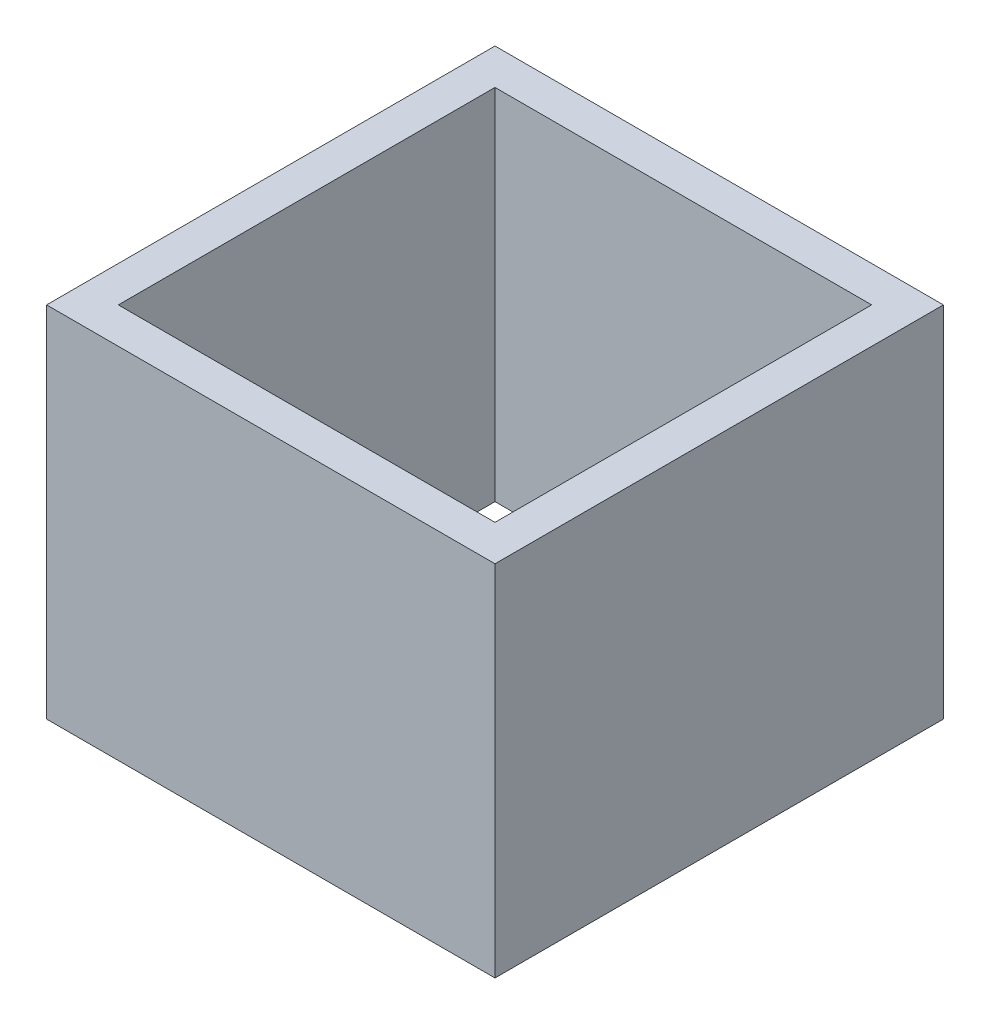
ISO-10303-21;
HEADER;
FILE_DESCRIPTION(('STEP AP214'),'2;1');
FILE_NAME('part.step','',(''),(''),'','','');
FILE_SCHEMA(('AUTOMOTIVE_DESIGN { 1 0 10303 214 1 1 1 1 }'));
ENDSEC;
DATA;
#1=APPLICATION_CONTEXT('core data for automotive mechanical design processes');
#2=APPLICATION_PROTOCOL_DEFINITION('international standard','automotive_design',2000,#1);
#3=PRODUCT_CONTEXT('',#1,'mechanical');
#4=PRODUCT('Part','Part','',(#3));
#5=PRODUCT_RELATED_PRODUCT_CATEGORY('part','',(#4));
#6=PRODUCT_DEFINITION_FORMATION('','',#4);
#7=PRODUCT_DEFINITION_CONTEXT('part definition',#1,'design');
#8=PRODUCT_DEFINITION('design','',#6,#7);
#9=PRODUCT_DEFINITION_SHAPE('','',#8);
#10=(LENGTH_UNIT() NAMED_UNIT(*) SI_UNIT(.MILLI.,.METRE.));
#11=(NAMED_UNIT(*) PLANE_ANGLE_UNIT() SI_UNIT($,.RADIAN.));
#12=(NAMED_UNIT(*) SI_UNIT($,.STERADIAN.) SOLID_ANGLE_UNIT());
#13=UNCERTAINTY_MEASURE_WITH_UNIT(LENGTH_MEASURE(1.E-05),#10,'distance_accuracy_value','');
#14=(GEOMETRIC_REPRESENTATION_CONTEXT(3) GLOBAL_UNCERTAINTY_ASSIGNED_CONTEXT((#13)) GLOBAL_UNIT_ASSIGNED_CONTEXT((#10,
#11,#12)) REPRESENTATION_CONTEXT('',''));
#15=CARTESIAN_POINT('',(0.,0.,0.));
#16=DIRECTION('',(0.,0.,1.));
#17=DIRECTION('',(1.,0.,0.));
#18=AXIS2_PLACEMENT_3D('',#15,#16,#17);
#19=CARTESIAN_POINT('',(0.,20.,0.));
#20=DIRECTION('',(0.,1.,0.));
#21=DIRECTION('',(0.,0.,1.));
#22=AXIS2_PLACEMENT_3D('',#19,#20,#21);
#23=PLANE('',#22);
#24=DIRECTION('',(0.,0.,-1.));
#25=VECTOR('',#24,1.);
#26=CARTESIAN_POINT('',(12.5,20.,12.5));
#27=LINE('',#26,#25);
#28=CARTESIAN_POINT('',(12.5,20.,12.5));
#29=VERTEX_POINT('',#28);
#30=CARTESIAN_POINT('',(12.5,20.,-12.5));
#31=VERTEX_POINT('',#30);
#32=EDGE_CURVE('E162',#29,#31,#27,.T.);
#33=ORIENTED_EDGE('',*,*,#32,.T.);
#34=DIRECTION('',(-1.,0.,0.));
#35=VECTOR('',#34,1.);
#36=CARTESIAN_POINT('',(-12.5,20.,-12.5));
#37=LINE('',#36,#35);
#38=CARTESIAN_POINT('',(-12.5,20.,-12.5));
#39=VERTEX_POINT('',#38);
#40=EDGE_CURVE('E165',#31,#39,#37,.T.);
#41=ORIENTED_EDGE('',*,*,#40,.T.);
#42=DIRECTION('',(0.,0.,1.));
#43=VECTOR('',#42,1.);
#44=CARTESIAN_POINT('',(-12.5,20.,12.5));
#45=LINE('',#44,#43);
#46=CARTESIAN_POINT('',(-12.5,20.,12.5));
#47=VERTEX_POINT('',#46);
#48=EDGE_CURVE('E168',#39,#47,#45,.T.);
#49=ORIENTED_EDGE('',*,*,#48,.T.);
#50=DIRECTION('',(1.,0.,0.));
#51=VECTOR('',#50,1.);
#52=CARTESIAN_POINT('',(-12.5,20.,12.5));
#53=LINE('',#52,#51);
#54=EDGE_CURVE('E170',#47,#29,#53,.T.);
#55=ORIENTED_EDGE('',*,*,#54,.T.);
#56=EDGE_LOOP('',(#33,#41,#49,#55));
#57=FACE_BOUND('',#56,.T.);
#58=DIRECTION('',(-1.,0.,0.));
#59=VECTOR('',#58,1.);
#60=CARTESIAN_POINT('',(0.,20.,-10.5));
#61=LINE('',#60,#59);
#62=CARTESIAN_POINT('',(10.5,20.,-10.5));
#63=VERTEX_POINT('',#62);
#64=CARTESIAN_POINT('',(-10.5,20.,-10.5));
#65=VERTEX_POINT('',#64);
#66=EDGE_CURVE('E134',#63,#65,#61,.T.);
#67=ORIENTED_EDGE('',*,*,#66,.F.);
#68=DIRECTION('',(0.,0.,-1.));
#69=VECTOR('',#68,1.);
#70=CARTESIAN_POINT('',(10.5,20.,0.));
#71=LINE('',#70,#69);
#72=CARTESIAN_POINT('',(10.5,20.,10.5));
#73=VERTEX_POINT('',#72);
#74=EDGE_CURVE('E126',#73,#63,#71,.T.);
#75=ORIENTED_EDGE('',*,*,#74,.F.);
#76=DIRECTION('',(1.,0.,0.));
#77=VECTOR('',#76,1.);
#78=CARTESIAN_POINT('',(0.,20.,10.5));
#79=LINE('',#78,#77);
#80=CARTESIAN_POINT('',(-10.5,20.,10.5));
#81=VERTEX_POINT('',#80);
#82=EDGE_CURVE('E148',#81,#73,#79,.T.);
#83=ORIENTED_EDGE('',*,*,#82,.F.);
#84=DIRECTION('',(0.,0.,1.));
#85=VECTOR('',#84,1.);
#86=CARTESIAN_POINT('',(-10.5,20.,0.));
#87=LINE('',#86,#85);
#88=EDGE_CURVE('E146',#65,#81,#87,.T.);
#89=ORIENTED_EDGE('',*,*,#88,.F.);
#90=EDGE_LOOP('',(#67,#75,#83,#89));
#91=FACE_BOUND('',#90,.T.);
#92=ADVANCED_FACE('F61',(#57,#91),#23,.T.);
#93=CARTESIAN_POINT('',(0.,0.,0.));
#94=DIRECTION('',(0.,1.,0.));
#95=DIRECTION('',(0.,0.,1.));
#96=AXIS2_PLACEMENT_3D('',#93,#94,#95);
#97=PLANE('',#96);
#98=DIRECTION('',(0.,0.,-1.));
#99=VECTOR('',#98,1.);
#100=CARTESIAN_POINT('',(12.5,0.,12.5));
#101=LINE('',#100,#99);
#102=CARTESIAN_POINT('',(12.5,0.,12.5));
#103=VERTEX_POINT('',#102);
#104=CARTESIAN_POINT('',(12.5,0.,-12.5));
#105=VERTEX_POINT('',#104);
#106=EDGE_CURVE('E142',#103,#105,#101,.T.);
#107=ORIENTED_EDGE('',*,*,#106,.F.);
#108=DIRECTION('',(1.,0.,0.));
#109=VECTOR('',#108,1.);
#110=CARTESIAN_POINT('',(-12.5,0.,12.5));
#111=LINE('',#110,#109);
#112=CARTESIAN_POINT('',(-12.5,0.,12.5));
#113=VERTEX_POINT('',#112);
#114=EDGE_CURVE('E166',#113,#103,#111,.T.);
#115=ORIENTED_EDGE('',*,*,#114,.F.);
#116=DIRECTION('',(0.,0.,1.));
#117=VECTOR('',#116,1.);
#118=CARTESIAN_POINT('',(-12.5,0.,12.5));
#119=LINE('',#118,#117);
#120=CARTESIAN_POINT('',(-12.5,0.,-12.5));
#121=VERTEX_POINT('',#120);
#122=EDGE_CURVE('E177',#121,#113,#119,.T.);
#123=ORIENTED_EDGE('',*,*,#122,.F.);
#124=DIRECTION('',(-1.,0.,0.));
#125=VECTOR('',#124,1.);
#126=CARTESIAN_POINT('',(-12.5,0.,-12.5));
#127=LINE('',#126,#125);
#128=EDGE_CURVE('E175',#105,#121,#127,.T.);
#129=ORIENTED_EDGE('',*,*,#128,.F.);
#130=EDGE_LOOP('',(#107,#115,#123,#129));
#131=FACE_BOUND('',#130,.T.);
#132=DIRECTION('',(0.,0.,-1.));
#133=VECTOR('',#132,1.);
#134=CARTESIAN_POINT('',(10.5,0.,0.));
#135=LINE('',#134,#133);
#136=CARTESIAN_POINT('',(10.5,0.,10.5));
#137=VERTEX_POINT('',#136);
#138=CARTESIAN_POINT('',(10.5,0.,-10.5));
#139=VERTEX_POINT('',#138);
#140=EDGE_CURVE('E84',#137,#139,#135,.T.);
#141=ORIENTED_EDGE('',*,*,#140,.T.);
#142=DIRECTION('',(-1.,0.,0.));
#143=VECTOR('',#142,1.);
#144=CARTESIAN_POINT('',(0.,0.,-10.5));
#145=LINE('',#144,#143);
#146=CARTESIAN_POINT('',(-10.5,0.,-10.5));
#147=VERTEX_POINT('',#146);
#148=EDGE_CURVE('E141',#139,#147,#145,.T.);
#149=ORIENTED_EDGE('',*,*,#148,.T.);
#150=DIRECTION('',(0.,0.,1.));
#151=VECTOR('',#150,1.);
#152=CARTESIAN_POINT('',(-10.5,0.,0.));
#153=LINE('',#152,#151);
#154=CARTESIAN_POINT('',(-10.5,0.,10.5));
#155=VERTEX_POINT('',#154);
#156=EDGE_CURVE('E154',#147,#155,#153,.T.);
#157=ORIENTED_EDGE('',*,*,#156,.T.);
#158=DIRECTION('',(1.,0.,0.));
#159=VECTOR('',#158,1.);
#160=CARTESIAN_POINT('',(0.,0.,10.5));
#161=LINE('',#160,#159);
#162=EDGE_CURVE('E135',#155,#137,#161,.T.);
#163=ORIENTED_EDGE('',*,*,#162,.T.);
#164=EDGE_LOOP('',(#141,#149,#157,#163));
#165=FACE_BOUND('',#164,.T.);
#166=ADVANCED_FACE('F195',(#131,#165),#97,.F.);
#167=CARTESIAN_POINT('',(12.5,20.,12.5));
#168=DIRECTION('',(-1.,0.,0.));
#169=DIRECTION('',(0.,0.,1.));
#170=AXIS2_PLACEMENT_3D('',#167,#168,#169);
#171=PLANE('',#170);
#172=ORIENTED_EDGE('',*,*,#106,.T.);
#173=DIRECTION('',(0.,-1.,0.));
#174=VECTOR('',#173,1.);
#175=CARTESIAN_POINT('',(12.5,20.,-12.5));
#176=LINE('',#175,#174);
#177=EDGE_CURVE('E12',#31,#105,#176,.T.);
#178=ORIENTED_EDGE('',*,*,#177,.F.);
#179=ORIENTED_EDGE('',*,*,#32,.F.);
#180=DIRECTION('',(0.,-1.,0.));
#181=VECTOR('',#180,1.);
#182=CARTESIAN_POINT('',(12.5,20.,12.5));
#183=LINE('',#182,#181);
#184=EDGE_CURVE('E172',#29,#103,#183,.T.);
#185=ORIENTED_EDGE('',*,*,#184,.T.);
#186=EDGE_LOOP('',(#172,#178,#179,#185));
#187=FACE_BOUND('',#186,.T.);
#188=ADVANCED_FACE('F63',(#187),#171,.F.);
#189=CARTESIAN_POINT('',(-12.5,20.,-12.5));
#190=DIRECTION('',(0.,0.,1.));
#191=DIRECTION('',(1.,0.,0.));
#192=AXIS2_PLACEMENT_3D('',#189,#190,#191);
#193=PLANE('',#192);
#194=ORIENTED_EDGE('',*,*,#128,.T.);
#195=DIRECTION('',(0.,-1.,0.));
#196=VECTOR('',#195,1.);
#197=CARTESIAN_POINT('',(-12.5,20.,-12.5));
#198=LINE('',#197,#196);
#199=EDGE_CURVE('E69',#39,#121,#198,.T.);
#200=ORIENTED_EDGE('',*,*,#199,.F.);
#201=ORIENTED_EDGE('',*,*,#40,.F.);
#202=ORIENTED_EDGE('',*,*,#177,.T.);
#203=EDGE_LOOP('',(#194,#200,#201,#202));
#204=FACE_BOUND('',#203,.T.);
#205=ADVANCED_FACE('F205',(#204),#193,.F.);
#206=CARTESIAN_POINT('',(-12.5,20.,12.5));
#207=DIRECTION('',(1.,0.,0.));
#208=DIRECTION('',(0.,0.,-1.));
#209=AXIS2_PLACEMENT_3D('',#206,#207,#208);
#210=PLANE('',#209);
#211=ORIENTED_EDGE('',*,*,#122,.T.);
#212=DIRECTION('',(0.,-1.,0.));
#213=VECTOR('',#212,1.);
#214=CARTESIAN_POINT('',(-12.5,20.,12.5));
#215=LINE('',#214,#213);
#216=EDGE_CURVE('E182',#47,#113,#215,.T.);
#217=ORIENTED_EDGE('',*,*,#216,.F.);
#218=ORIENTED_EDGE('',*,*,#48,.F.);
#219=ORIENTED_EDGE('',*,*,#199,.T.);
#220=EDGE_LOOP('',(#211,#217,#218,#219));
#221=FACE_BOUND('',#220,.T.);
#222=ADVANCED_FACE('F189',(#221),#210,.F.);
#223=CARTESIAN_POINT('',(-12.5,20.,12.5));
#224=DIRECTION('',(0.,0.,-1.));
#225=DIRECTION('',(-1.,0.,0.));
#226=AXIS2_PLACEMENT_3D('',#223,#224,#225);
#227=PLANE('',#226);
#228=ORIENTED_EDGE('',*,*,#114,.T.);
#229=ORIENTED_EDGE('',*,*,#184,.F.);
#230=ORIENTED_EDGE('',*,*,#54,.F.);
#231=ORIENTED_EDGE('',*,*,#216,.T.);
#232=EDGE_LOOP('',(#228,#229,#230,#231));
#233=FACE_BOUND('',#232,.T.);
#234=ADVANCED_FACE('F199',(#233),#227,.F.);
#235=CARTESIAN_POINT('',(10.5,20.,0.));
#236=DIRECTION('',(-1.,0.,0.));
#237=DIRECTION('',(0.,0.,1.));
#238=AXIS2_PLACEMENT_3D('',#235,#236,#237);
#239=PLANE('',#238);
#240=ORIENTED_EDGE('',*,*,#140,.F.);
#241=DIRECTION('',(0.,-1.,0.));
#242=VECTOR('',#241,1.);
#243=CARTESIAN_POINT('',(10.5,20.,10.5));
#244=LINE('',#243,#242);
#245=EDGE_CURVE('E130',#73,#137,#244,.T.);
#246=ORIENTED_EDGE('',*,*,#245,.F.);
#247=ORIENTED_EDGE('',*,*,#74,.T.);
#248=DIRECTION('',(0.,-1.,0.));
#249=VECTOR('',#248,1.);
#250=CARTESIAN_POINT('',(10.5,20.,-10.5));
#251=LINE('',#250,#249);
#252=EDGE_CURVE('E129',#63,#139,#251,.T.);
#253=ORIENTED_EDGE('',*,*,#252,.T.);
#254=EDGE_LOOP('',(#240,#246,#247,#253));
#255=FACE_BOUND('',#254,.T.);
#256=ADVANCED_FACE('F128',(#255),#239,.T.);
#257=CARTESIAN_POINT('',(0.,20.,-10.5));
#258=DIRECTION('',(0.,0.,1.));
#259=DIRECTION('',(1.,0.,0.));
#260=AXIS2_PLACEMENT_3D('',#257,#258,#259);
#261=PLANE('',#260);
#262=ORIENTED_EDGE('',*,*,#148,.F.);
#263=ORIENTED_EDGE('',*,*,#252,.F.);
#264=ORIENTED_EDGE('',*,*,#66,.T.);
#265=DIRECTION('',(0.,-1.,0.));
#266=VECTOR('',#265,1.);
#267=CARTESIAN_POINT('',(-10.5,20.,-10.5));
#268=LINE('',#267,#266);
#269=EDGE_CURVE('E143',#65,#147,#268,.T.);
#270=ORIENTED_EDGE('',*,*,#269,.T.);
#271=EDGE_LOOP('',(#262,#263,#264,#270));
#272=FACE_BOUND('',#271,.T.);
#273=ADVANCED_FACE('F138',(#272),#261,.T.);
#274=CARTESIAN_POINT('',(-10.5,20.,0.));
#275=DIRECTION('',(1.,0.,0.));
#276=DIRECTION('',(0.,0.,-1.));
#277=AXIS2_PLACEMENT_3D('',#274,#275,#276);
#278=PLANE('',#277);
#279=ORIENTED_EDGE('',*,*,#156,.F.);
#280=ORIENTED_EDGE('',*,*,#269,.F.);
#281=ORIENTED_EDGE('',*,*,#88,.T.);
#282=DIRECTION('',(0.,-1.,0.));
#283=VECTOR('',#282,1.);
#284=CARTESIAN_POINT('',(-10.5,20.,10.5));
#285=LINE('',#284,#283);
#286=EDGE_CURVE('E76',#81,#155,#285,.T.);
#287=ORIENTED_EDGE('',*,*,#286,.T.);
#288=EDGE_LOOP('',(#279,#280,#281,#287));
#289=FACE_BOUND('',#288,.T.);
#290=ADVANCED_FACE('F228',(#289),#278,.T.);
#291=CARTESIAN_POINT('',(0.,20.,10.5));
#292=DIRECTION('',(0.,0.,-1.));
#293=DIRECTION('',(-1.,0.,0.));
#294=AXIS2_PLACEMENT_3D('',#291,#292,#293);
#295=PLANE('',#294);
#296=ORIENTED_EDGE('',*,*,#162,.F.);
#297=ORIENTED_EDGE('',*,*,#286,.F.);
#298=ORIENTED_EDGE('',*,*,#82,.T.);
#299=ORIENTED_EDGE('',*,*,#245,.T.);
#300=EDGE_LOOP('',(#296,#297,#298,#299));
#301=FACE_BOUND('',#300,.T.);
#302=ADVANCED_FACE('F232',(#301),#295,.T.);
#303=CLOSED_SHELL('',(#92,#166,#188,#205,#222,#234,#256,#273,#290,#302));
#304=MANIFOLD_SOLID_BREP('B2',#303);
#305=ADVANCED_BREP_SHAPE_REPRESENTATION('',(#18,#304),#14);
#306=SHAPE_DEFINITION_REPRESENTATION(#9,#305);
ENDSEC;
END-ISO-10303-21;
